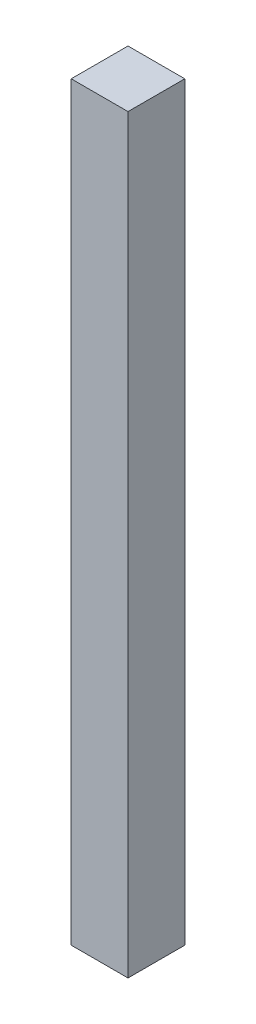
ISO-10303-21;
HEADER;
FILE_DESCRIPTION(('STEP AP214'),'2;1');
FILE_NAME('part.step','',(''),(''),'','','');
FILE_SCHEMA(('AUTOMOTIVE_DESIGN { 1 0 10303 214 1 1 1 1 }'));
ENDSEC;
DATA;
#1=APPLICATION_CONTEXT('core data for automotive mechanical design processes');
#2=APPLICATION_PROTOCOL_DEFINITION('international standard','automotive_design',2000,#1);
#3=PRODUCT_CONTEXT('',#1,'mechanical');
#4=PRODUCT('Part','Part','',(#3));
#5=PRODUCT_RELATED_PRODUCT_CATEGORY('part','',(#4));
#6=PRODUCT_DEFINITION_FORMATION('','',#4);
#7=PRODUCT_DEFINITION_CONTEXT('part definition',#1,'design');
#8=PRODUCT_DEFINITION('design','',#6,#7);
#9=PRODUCT_DEFINITION_SHAPE('','',#8);
#10=(LENGTH_UNIT() NAMED_UNIT(*) SI_UNIT(.MILLI.,.METRE.));
#11=(NAMED_UNIT(*) PLANE_ANGLE_UNIT() SI_UNIT($,.RADIAN.));
#12=(NAMED_UNIT(*) SI_UNIT($,.STERADIAN.) SOLID_ANGLE_UNIT());
#13=UNCERTAINTY_MEASURE_WITH_UNIT(LENGTH_MEASURE(1.E-05),#10,'distance_accuracy_value','');
#14=(GEOMETRIC_REPRESENTATION_CONTEXT(3) GLOBAL_UNCERTAINTY_ASSIGNED_CONTEXT((#13)) GLOBAL_UNIT_ASSIGNED_CONTEXT((#10,
#11,#12)) REPRESENTATION_CONTEXT('',''));
#15=CARTESIAN_POINT('',(0.,0.,0.));
#16=DIRECTION('',(0.,0.,1.));
#17=DIRECTION('',(1.,0.,0.));
#18=AXIS2_PLACEMENT_3D('',#15,#16,#17);
#19=CARTESIAN_POINT('',(0.,1174.75,0.));
#20=DIRECTION('',(-1.,0.,0.));
#21=DIRECTION('',(0.,0.,1.));
#22=AXIS2_PLACEMENT_3D('',#19,#20,#21);
#23=PLANE('',#22);
#24=DIRECTION('',(0.,0.,-1.));
#25=VECTOR('',#24,1.);
#26=CARTESIAN_POINT('',(0.,0.,0.));
#27=LINE('',#26,#25);
#28=CARTESIAN_POINT('',(0.,0.,0.));
#29=VERTEX_POINT('',#28);
#30=CARTESIAN_POINT('',(0.,0.,-88.9));
#31=VERTEX_POINT('',#30);
#32=EDGE_CURVE('E109',#29,#31,#27,.T.);
#33=ORIENTED_EDGE('',*,*,#32,.T.);
#34=DIRECTION('',(0.,-1.,0.));
#35=VECTOR('',#34,1.);
#36=CARTESIAN_POINT('',(0.,1174.75,-88.9));
#37=LINE('',#36,#35);
#38=CARTESIAN_POINT('',(0.,1174.75,-88.9));
#39=VERTEX_POINT('',#38);
#40=EDGE_CURVE('E11',#39,#31,#37,.T.);
#41=ORIENTED_EDGE('',*,*,#40,.F.);
#42=DIRECTION('',(0.,0.,-1.));
#43=VECTOR('',#42,1.);
#44=CARTESIAN_POINT('',(0.,1174.75,0.));
#45=LINE('',#44,#43);
#46=CARTESIAN_POINT('',(0.,1174.75,0.));
#47=VERTEX_POINT('',#46);
#48=EDGE_CURVE('E93',#47,#39,#45,.T.);
#49=ORIENTED_EDGE('',*,*,#48,.F.);
#50=DIRECTION('',(0.,-1.,0.));
#51=VECTOR('',#50,1.);
#52=CARTESIAN_POINT('',(0.,1174.75,0.));
#53=LINE('',#52,#51);
#54=EDGE_CURVE('E105',#47,#29,#53,.T.);
#55=ORIENTED_EDGE('',*,*,#54,.T.);
#56=EDGE_LOOP('',(#33,#41,#49,#55));
#57=FACE_BOUND('',#56,.T.);
#58=ADVANCED_FACE('F41',(#57),#23,.F.);
#59=CARTESIAN_POINT('',(0.,1174.75,-88.9));
#60=DIRECTION('',(0.,0.,1.));
#61=DIRECTION('',(1.,0.,0.));
#62=AXIS2_PLACEMENT_3D('',#59,#60,#61);
#63=PLANE('',#62);
#64=DIRECTION('',(-1.,0.,0.));
#65=VECTOR('',#64,1.);
#66=CARTESIAN_POINT('',(0.,0.,-88.9));
#67=LINE('',#66,#65);
#68=CARTESIAN_POINT('',(-88.9,0.,-88.9));
#69=VERTEX_POINT('',#68);
#70=EDGE_CURVE('E98',#31,#69,#67,.T.);
#71=ORIENTED_EDGE('',*,*,#70,.T.);
#72=DIRECTION('',(0.,-1.,0.));
#73=VECTOR('',#72,1.);
#74=CARTESIAN_POINT('',(-88.9,1174.75,-88.9));
#75=LINE('',#74,#73);
#76=CARTESIAN_POINT('',(-88.9,1174.75,-88.9));
#77=VERTEX_POINT('',#76);
#78=EDGE_CURVE('E50',#77,#69,#75,.T.);
#79=ORIENTED_EDGE('',*,*,#78,.F.);
#80=DIRECTION('',(-1.,0.,0.));
#81=VECTOR('',#80,1.);
#82=CARTESIAN_POINT('',(0.,1174.75,-88.9));
#83=LINE('',#82,#81);
#84=EDGE_CURVE('E88',#39,#77,#83,.T.);
#85=ORIENTED_EDGE('',*,*,#84,.F.);
#86=ORIENTED_EDGE('',*,*,#40,.T.);
#87=EDGE_LOOP('',(#71,#79,#85,#86));
#88=FACE_BOUND('',#87,.T.);
#89=ADVANCED_FACE('F97',(#88),#63,.F.);
#90=CARTESIAN_POINT('',(-88.9,1174.75,-88.9));
#91=DIRECTION('',(1.,0.,0.));
#92=DIRECTION('',(0.,0.,-1.));
#93=AXIS2_PLACEMENT_3D('',#90,#91,#92);
#94=PLANE('',#93);
#95=DIRECTION('',(0.,0.,1.));
#96=VECTOR('',#95,1.);
#97=CARTESIAN_POINT('',(-88.9,0.,-88.9));
#98=LINE('',#97,#96);
#99=CARTESIAN_POINT('',(-88.9,0.,0.));
#100=VERTEX_POINT('',#99);
#101=EDGE_CURVE('E75',#69,#100,#98,.T.);
#102=ORIENTED_EDGE('',*,*,#101,.T.);
#103=DIRECTION('',(0.,-1.,0.));
#104=VECTOR('',#103,1.);
#105=CARTESIAN_POINT('',(-88.9,1174.75,0.));
#106=LINE('',#105,#104);
#107=CARTESIAN_POINT('',(-88.9,1174.75,0.));
#108=VERTEX_POINT('',#107);
#109=EDGE_CURVE('E100',#108,#100,#106,.T.);
#110=ORIENTED_EDGE('',*,*,#109,.F.);
#111=DIRECTION('',(0.,0.,1.));
#112=VECTOR('',#111,1.);
#113=CARTESIAN_POINT('',(-88.9,1174.75,-88.9));
#114=LINE('',#113,#112);
#115=EDGE_CURVE('E91',#77,#108,#114,.T.);
#116=ORIENTED_EDGE('',*,*,#115,.F.);
#117=ORIENTED_EDGE('',*,*,#78,.T.);
#118=EDGE_LOOP('',(#102,#110,#116,#117));
#119=FACE_BOUND('',#118,.T.);
#120=ADVANCED_FACE('F101',(#119),#94,.F.);
#121=CARTESIAN_POINT('',(-88.9,1174.75,0.));
#122=DIRECTION('',(0.,0.,-1.));
#123=DIRECTION('',(-1.,0.,0.));
#124=AXIS2_PLACEMENT_3D('',#121,#122,#123);
#125=PLANE('',#124);
#126=DIRECTION('',(1.,0.,0.));
#127=VECTOR('',#126,1.);
#128=CARTESIAN_POINT('',(-88.9,0.,0.));
#129=LINE('',#128,#127);
#130=EDGE_CURVE('E81',#100,#29,#129,.T.);
#131=ORIENTED_EDGE('',*,*,#130,.T.);
#132=ORIENTED_EDGE('',*,*,#54,.F.);
#133=DIRECTION('',(1.,0.,0.));
#134=VECTOR('',#133,1.);
#135=CARTESIAN_POINT('',(-88.9,1174.75,0.));
#136=LINE('',#135,#134);
#137=EDGE_CURVE('E58',#108,#47,#136,.T.);
#138=ORIENTED_EDGE('',*,*,#137,.F.);
#139=ORIENTED_EDGE('',*,*,#109,.T.);
#140=EDGE_LOOP('',(#131,#132,#138,#139));
#141=FACE_BOUND('',#140,.T.);
#142=ADVANCED_FACE('F122',(#141),#125,.F.);
#143=CARTESIAN_POINT('',(0.,1174.75,0.));
#144=DIRECTION('',(0.,1.,0.));
#145=DIRECTION('',(0.,0.,1.));
#146=AXIS2_PLACEMENT_3D('',#143,#144,#145);
#147=PLANE('',#146);
#148=ORIENTED_EDGE('',*,*,#48,.T.);
#149=ORIENTED_EDGE('',*,*,#84,.T.);
#150=ORIENTED_EDGE('',*,*,#115,.T.);
#151=ORIENTED_EDGE('',*,*,#137,.T.);
#152=EDGE_LOOP('',(#148,#149,#150,#151));
#153=FACE_BOUND('',#152,.T.);
#154=ADVANCED_FACE('F89',(#153),#147,.T.);
#155=CARTESIAN_POINT('',(0.,0.,0.));
#156=DIRECTION('',(0.,1.,0.));
#157=DIRECTION('',(0.,0.,1.));
#158=AXIS2_PLACEMENT_3D('',#155,#156,#157);
#159=PLANE('',#158);
#160=ORIENTED_EDGE('',*,*,#32,.F.);
#161=ORIENTED_EDGE('',*,*,#130,.F.);
#162=ORIENTED_EDGE('',*,*,#101,.F.);
#163=ORIENTED_EDGE('',*,*,#70,.F.);
#164=EDGE_LOOP('',(#160,#161,#162,#163));
#165=FACE_BOUND('',#164,.T.);
#166=ADVANCED_FACE('F125',(#165),#159,.F.);
#167=CLOSED_SHELL('',(#58,#89,#120,#142,#154,#166));
#168=MANIFOLD_SOLID_BREP('B2',#167);
#169=ADVANCED_BREP_SHAPE_REPRESENTATION('',(#18,#168),#14);
#170=SHAPE_DEFINITION_REPRESENTATION(#9,#169);
ENDSEC;
END-ISO-10303-21;
